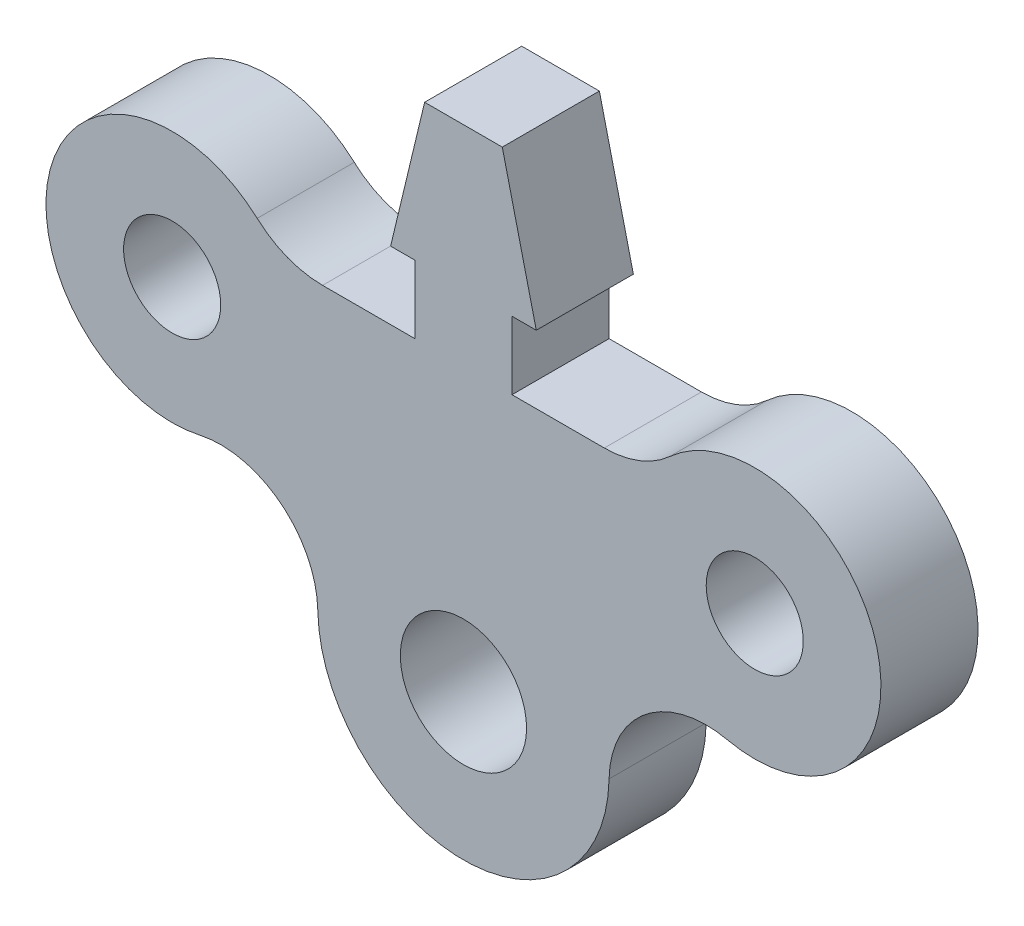
ISO-10303-21;
HEADER;
FILE_DESCRIPTION(('STEP AP214'),'2;1');
FILE_NAME('part.step','',(''),(''),'','','');
FILE_SCHEMA(('AUTOMOTIVE_DESIGN { 1 0 10303 214 1 1 1 1 }'));
ENDSEC;
DATA;
#1=APPLICATION_CONTEXT('core data for automotive mechanical design processes');
#2=APPLICATION_PROTOCOL_DEFINITION('international standard','automotive_design',2000,#1);
#3=PRODUCT_CONTEXT('',#1,'mechanical');
#4=PRODUCT('Part','Part','',(#3));
#5=PRODUCT_RELATED_PRODUCT_CATEGORY('part','',(#4));
#6=PRODUCT_DEFINITION_FORMATION('','',#4);
#7=PRODUCT_DEFINITION_CONTEXT('part definition',#1,'design');
#8=PRODUCT_DEFINITION('design','',#6,#7);
#9=PRODUCT_DEFINITION_SHAPE('','',#8);
#10=(LENGTH_UNIT() NAMED_UNIT(*) SI_UNIT(.MILLI.,.METRE.));
#11=(NAMED_UNIT(*) PLANE_ANGLE_UNIT() SI_UNIT($,.RADIAN.));
#12=(NAMED_UNIT(*) SI_UNIT($,.STERADIAN.) SOLID_ANGLE_UNIT());
#13=UNCERTAINTY_MEASURE_WITH_UNIT(LENGTH_MEASURE(1.E-05),#10,'distance_accuracy_value','');
#14=(GEOMETRIC_REPRESENTATION_CONTEXT(3) GLOBAL_UNCERTAINTY_ASSIGNED_CONTEXT((#13)) GLOBAL_UNIT_ASSIGNED_CONTEXT((#10,
#11,#12)) REPRESENTATION_CONTEXT('',''));
#15=CARTESIAN_POINT('',(0.,0.,0.));
#16=DIRECTION('',(0.,0.,1.));
#17=DIRECTION('',(1.,0.,0.));
#18=AXIS2_PLACEMENT_3D('',#15,#16,#17);
#19=CARTESIAN_POINT('',(33.9601166025852,20.106578028394,10.));
#20=DIRECTION('',(0.,0.,1.));
#21=DIRECTION('',(1.,0.,0.));
#22=AXIS2_PLACEMENT_3D('',#19,#20,#21);
#23=PLANE('',#22);
#24=CARTESIAN_POINT('',(49.4520499874148,3.10657802839401,10.));
#25=DIRECTION('',(0.,0.,1.));
#26=DIRECTION('',(-1.,0.,0.));
#27=AXIS2_PLACEMENT_3D('',#24,#25,#26);
#28=CIRCLE('',#27,4.99999999999998);
#29=CARTESIAN_POINT('',(44.4520499874148,3.10657802839401,10.));
#30=VERTEX_POINT('',#29);
#31=EDGE_CURVE('E394',#30,#30,#28,.T.);
#32=ORIENTED_EDGE('',*,*,#31,.F.);
#33=EDGE_LOOP('',(#32));
#34=FACE_BOUND('',#33,.T.);
#35=DIRECTION('',(0.,-1.,0.));
#36=VECTOR('',#35,1.);
#37=CARTESIAN_POINT('',(14.4520499874148,10.106578028394,10.));
#38=LINE('',#37,#36);
#39=CARTESIAN_POINT('',(14.4520499874148,17.106578028394,10.));
#40=VERTEX_POINT('',#39);
#41=CARTESIAN_POINT('',(14.4520499874148,10.106578028394,10.));
#42=VERTEX_POINT('',#41);
#43=EDGE_CURVE('E238',#40,#42,#38,.T.);
#44=ORIENTED_EDGE('',*,*,#43,.T.);
#45=DIRECTION('',(-1.,0.,0.));
#46=VECTOR('',#45,1.);
#47=CARTESIAN_POINT('',(14.4520499874148,10.106578028394,10.));
#48=LINE('',#47,#46);
#49=CARTESIAN_POINT('',(4.94398337224448,10.106578028394,10.));
#50=VERTEX_POINT('',#49);
#51=EDGE_CURVE('E126',#42,#50,#48,.T.);
#52=ORIENTED_EDGE('',*,*,#51,.T.);
#53=CARTESIAN_POINT('',(4.94398337224448,20.106578028394,10.));
#54=DIRECTION('',(0.,0.,-1.));
#55=DIRECTION('',(-1.,0.,0.));
#56=AXIS2_PLACEMENT_3D('',#53,#54,#55);
#57=CIRCLE('',#56,10.);
#58=CARTESIAN_POINT('',(-1.79163983855102,12.7152736805679,10.));
#59=VERTEX_POINT('',#58);
#60=EDGE_CURVE('E291',#50,#59,#57,.T.);
#61=ORIENTED_EDGE('',*,*,#60,.T.);
#62=CARTESIAN_POINT('',(-10.5479500125852,3.10657802839401,10.));
#63=DIRECTION('',(0.,0.,1.));
#64=DIRECTION('',(1.,0.,0.));
#65=AXIS2_PLACEMENT_3D('',#62,#63,#64);
#66=CIRCLE('',#65,13.);
#67=CARTESIAN_POINT('',(-7.71958344059088,-9.58201300979558,10.));
#68=VERTEX_POINT('',#67);
#69=EDGE_CURVE('E311',#59,#68,#66,.T.);
#70=ORIENTED_EDGE('',*,*,#69,.T.);
#71=CARTESIAN_POINT('',(-5.5439168467491,-19.3424676545568,10.));
#72=DIRECTION('',(0.,0.,-1.));
#73=DIRECTION('',(-1.,0.,0.));
#74=AXIS2_PLACEMENT_3D('',#71,#72,#73);
#75=CIRCLE('',#74,10.);
#76=CARTESIAN_POINT('',(4.45446988691647,-19.1628493813765,10.));
#77=VERTEX_POINT('',#76);
#78=EDGE_CURVE('E307',#68,#77,#75,.T.);
#79=ORIENTED_EDGE('',*,*,#78,.T.);
#80=CARTESIAN_POINT('',(19.4520499874148,-18.893421971606,10.));
#81=DIRECTION('',(0.,0.,1.));
#82=DIRECTION('',(1.,0.,0.));
#83=AXIS2_PLACEMENT_3D('',#80,#81,#82);
#84=CIRCLE('',#83,15.);
#85=CARTESIAN_POINT('',(34.4496300879132,-19.1628493813765,10.));
#86=VERTEX_POINT('',#85);
#87=EDGE_CURVE('E310',#77,#86,#84,.T.);
#88=ORIENTED_EDGE('',*,*,#87,.T.);
#89=CARTESIAN_POINT('',(44.4480168215788,-19.3424676545568,10.));
#90=DIRECTION('',(0.,0.,-1.));
#91=DIRECTION('',(1.,0.,0.));
#92=AXIS2_PLACEMENT_3D('',#89,#90,#91);
#93=CIRCLE('',#92,10.);
#94=CARTESIAN_POINT('',(46.6236834154205,-9.58201300979558,10.));
#95=VERTEX_POINT('',#94);
#96=EDGE_CURVE('E315',#86,#95,#93,.T.);
#97=ORIENTED_EDGE('',*,*,#96,.T.);
#98=CARTESIAN_POINT('',(49.4520499874148,3.10657802839401,10.));
#99=DIRECTION('',(0.,0.,1.));
#100=DIRECTION('',(-1.,0.,0.));
#101=AXIS2_PLACEMENT_3D('',#98,#99,#100);
#102=CIRCLE('',#101,13.);
#103=CARTESIAN_POINT('',(40.6957398133807,12.7152736805679,10.));
#104=VERTEX_POINT('',#103);
#105=EDGE_CURVE('E322',#95,#104,#102,.T.);
#106=ORIENTED_EDGE('',*,*,#105,.T.);
#107=CARTESIAN_POINT('',(33.9601166025852,20.106578028394,10.));
#108=DIRECTION('',(0.,0.,-1.));
#109=DIRECTION('',(1.,0.,0.));
#110=AXIS2_PLACEMENT_3D('',#107,#108,#109);
#111=CIRCLE('',#110,9.99999999999999);
#112=CARTESIAN_POINT('',(33.9601166025852,10.106578028394,10.));
#113=VERTEX_POINT('',#112);
#114=EDGE_CURVE('E325',#104,#113,#111,.T.);
#115=ORIENTED_EDGE('',*,*,#114,.T.);
#116=DIRECTION('',(-1.,0.,0.));
#117=VECTOR('',#116,1.);
#118=CARTESIAN_POINT('',(24.4520499874148,10.106578028394,10.));
#119=LINE('',#118,#117);
#120=CARTESIAN_POINT('',(24.4520499874148,10.106578028394,10.));
#121=VERTEX_POINT('',#120);
#122=EDGE_CURVE('E328',#113,#121,#119,.T.);
#123=ORIENTED_EDGE('',*,*,#122,.T.);
#124=DIRECTION('',(0.,1.,0.));
#125=VECTOR('',#124,1.);
#126=CARTESIAN_POINT('',(24.4520499874148,10.106578028394,10.));
#127=LINE('',#126,#125);
#128=CARTESIAN_POINT('',(24.4520499874148,17.106578028394,10.));
#129=VERTEX_POINT('',#128);
#130=EDGE_CURVE('E331',#121,#129,#127,.T.);
#131=ORIENTED_EDGE('',*,*,#130,.T.);
#132=DIRECTION('',(1.,0.,0.));
#133=VECTOR('',#132,1.);
#134=CARTESIAN_POINT('',(24.4520499874148,17.106578028394,10.));
#135=LINE('',#134,#133);
#136=CARTESIAN_POINT('',(26.9520499874148,17.106578028394,10.));
#137=VERTEX_POINT('',#136);
#138=EDGE_CURVE('E334',#129,#137,#135,.T.);
#139=ORIENTED_EDGE('',*,*,#138,.T.);
#140=DIRECTION('',(-0.233383056617011,0.972384876930992,0.));
#141=VECTOR('',#140,1.);
#142=CARTESIAN_POINT('',(26.9520499874148,17.106578028394,10.));
#143=LINE('',#142,#141);
#144=CARTESIAN_POINT('',(23.4513041381597,31.6923511823589,10.));
#145=VERTEX_POINT('',#144);
#146=EDGE_CURVE('E169',#137,#145,#143,.T.);
#147=ORIENTED_EDGE('',*,*,#146,.T.);
#148=DIRECTION('',(-1.,0.,0.));
#149=VECTOR('',#148,1.);
#150=CARTESIAN_POINT('',(23.4513041381597,31.6923511823589,10.));
#151=LINE('',#150,#149);
#152=CARTESIAN_POINT('',(15.45279583667,31.6923511823589,10.));
#153=VERTEX_POINT('',#152);
#154=EDGE_CURVE('E163',#145,#153,#151,.T.);
#155=ORIENTED_EDGE('',*,*,#154,.T.);
#156=DIRECTION('',(-0.233383056617011,-0.972384876930992,0.));
#157=VECTOR('',#156,1.);
#158=CARTESIAN_POINT('',(11.9520499874148,17.106578028394,10.));
#159=LINE('',#158,#157);
#160=CARTESIAN_POINT('',(11.9520499874148,17.106578028394,10.));
#161=VERTEX_POINT('',#160);
#162=EDGE_CURVE('E167',#153,#161,#159,.T.);
#163=ORIENTED_EDGE('',*,*,#162,.T.);
#164=DIRECTION('',(1.,0.,0.));
#165=VECTOR('',#164,1.);
#166=CARTESIAN_POINT('',(14.4520499874148,17.106578028394,10.));
#167=LINE('',#166,#165);
#168=EDGE_CURVE('E59',#161,#40,#167,.T.);
#169=ORIENTED_EDGE('',*,*,#168,.T.);
#170=EDGE_LOOP('',(#44,#52,#61,#70,#79,#88,#97,#106,#115,#123,#131,#139,#147,#155,#163,#169));
#171=FACE_BOUND('',#170,.T.);
#172=CARTESIAN_POINT('',(-10.5479500125852,3.10657802839401,10.));
#173=DIRECTION('',(0.,0.,1.));
#174=DIRECTION('',(1.,0.,0.));
#175=AXIS2_PLACEMENT_3D('',#172,#173,#174);
#176=CIRCLE('',#175,5.);
#177=CARTESIAN_POINT('',(-5.54795001258518,3.10657802839401,10.));
#178=VERTEX_POINT('',#177);
#179=EDGE_CURVE('E195',#178,#178,#176,.T.);
#180=ORIENTED_EDGE('',*,*,#179,.F.);
#181=EDGE_LOOP('',(#180));
#182=FACE_BOUND('',#181,.T.);
#183=CARTESIAN_POINT('',(19.4520499874148,-18.893421971606,10.));
#184=DIRECTION('',(0.,0.,1.));
#185=DIRECTION('',(1.,0.,0.));
#186=AXIS2_PLACEMENT_3D('',#183,#184,#185);
#187=CIRCLE('',#186,6.5);
#188=CARTESIAN_POINT('',(25.9520499874148,-18.893421971606,10.));
#189=VERTEX_POINT('',#188);
#190=EDGE_CURVE('E383',#189,#189,#187,.T.);
#191=ORIENTED_EDGE('',*,*,#190,.F.);
#192=EDGE_LOOP('',(#191));
#193=FACE_BOUND('',#192,.T.);
#194=ADVANCED_FACE('F41',(#34,#171,#182,#193),#23,.T.);
#195=CARTESIAN_POINT('',(33.9601166025852,20.106578028394,0.));
#196=DIRECTION('',(0.,0.,1.));
#197=DIRECTION('',(1.,0.,0.));
#198=AXIS2_PLACEMENT_3D('',#195,#196,#197);
#199=PLANE('',#198);
#200=DIRECTION('',(0.,-1.,0.));
#201=VECTOR('',#200,1.);
#202=CARTESIAN_POINT('',(14.4520499874148,10.106578028394,0.));
#203=LINE('',#202,#201);
#204=CARTESIAN_POINT('',(14.4520499874148,17.106578028394,0.));
#205=VERTEX_POINT('',#204);
#206=CARTESIAN_POINT('',(14.4520499874148,10.106578028394,0.));
#207=VERTEX_POINT('',#206);
#208=EDGE_CURVE('E190',#205,#207,#203,.T.);
#209=ORIENTED_EDGE('',*,*,#208,.F.);
#210=DIRECTION('',(1.,0.,0.));
#211=VECTOR('',#210,1.);
#212=CARTESIAN_POINT('',(14.4520499874148,17.106578028394,0.));
#213=LINE('',#212,#211);
#214=CARTESIAN_POINT('',(11.9520499874148,17.106578028394,0.));
#215=VERTEX_POINT('',#214);
#216=EDGE_CURVE('E118',#215,#205,#213,.T.);
#217=ORIENTED_EDGE('',*,*,#216,.F.);
#218=DIRECTION('',(-0.233383056617011,-0.972384876930992,0.));
#219=VECTOR('',#218,1.);
#220=CARTESIAN_POINT('',(11.9520499874148,17.106578028394,0.));
#221=LINE('',#220,#219);
#222=CARTESIAN_POINT('',(15.45279583667,31.6923511823589,0.));
#223=VERTEX_POINT('',#222);
#224=EDGE_CURVE('E112',#223,#215,#221,.T.);
#225=ORIENTED_EDGE('',*,*,#224,.F.);
#226=DIRECTION('',(-1.,0.,0.));
#227=VECTOR('',#226,1.);
#228=CARTESIAN_POINT('',(15.45279583667,31.6923511823589,0.));
#229=LINE('',#228,#227);
#230=CARTESIAN_POINT('',(23.4513041381597,31.6923511823589,0.));
#231=VERTEX_POINT('',#230);
#232=EDGE_CURVE('E177',#231,#223,#229,.T.);
#233=ORIENTED_EDGE('',*,*,#232,.F.);
#234=DIRECTION('',(-0.233383056617011,0.972384876930992,0.));
#235=VECTOR('',#234,1.);
#236=CARTESIAN_POINT('',(26.9520499874148,17.106578028394,0.));
#237=LINE('',#236,#235);
#238=CARTESIAN_POINT('',(26.9520499874148,17.106578028394,0.));
#239=VERTEX_POINT('',#238);
#240=EDGE_CURVE('E228',#239,#231,#237,.T.);
#241=ORIENTED_EDGE('',*,*,#240,.F.);
#242=DIRECTION('',(1.,0.,0.));
#243=VECTOR('',#242,1.);
#244=CARTESIAN_POINT('',(24.4520499874148,17.106578028394,0.));
#245=LINE('',#244,#243);
#246=CARTESIAN_POINT('',(24.4520499874148,17.106578028394,0.));
#247=VERTEX_POINT('',#246);
#248=EDGE_CURVE('E225',#247,#239,#245,.T.);
#249=ORIENTED_EDGE('',*,*,#248,.F.);
#250=DIRECTION('',(0.,1.,0.));
#251=VECTOR('',#250,1.);
#252=CARTESIAN_POINT('',(24.4520499874148,10.106578028394,0.));
#253=LINE('',#252,#251);
#254=CARTESIAN_POINT('',(24.4520499874148,10.106578028394,0.));
#255=VERTEX_POINT('',#254);
#256=EDGE_CURVE('E222',#255,#247,#253,.T.);
#257=ORIENTED_EDGE('',*,*,#256,.F.);
#258=DIRECTION('',(-1.,0.,0.));
#259=VECTOR('',#258,1.);
#260=CARTESIAN_POINT('',(24.4520499874148,10.106578028394,0.));
#261=LINE('',#260,#259);
#262=CARTESIAN_POINT('',(33.9601166025852,10.106578028394,0.));
#263=VERTEX_POINT('',#262);
#264=EDGE_CURVE('E219',#263,#255,#261,.T.);
#265=ORIENTED_EDGE('',*,*,#264,.F.);
#266=CARTESIAN_POINT('',(33.9601166025852,20.106578028394,0.));
#267=DIRECTION('',(0.,0.,-1.));
#268=DIRECTION('',(1.,0.,0.));
#269=AXIS2_PLACEMENT_3D('',#266,#267,#268);
#270=CIRCLE('',#269,9.99999999999999);
#271=CARTESIAN_POINT('',(40.6957398133807,12.7152736805679,0.));
#272=VERTEX_POINT('',#271);
#273=EDGE_CURVE('E216',#272,#263,#270,.T.);
#274=ORIENTED_EDGE('',*,*,#273,.F.);
#275=CARTESIAN_POINT('',(49.4520499874148,3.10657802839401,0.));
#276=DIRECTION('',(0.,0.,1.));
#277=DIRECTION('',(-1.,0.,0.));
#278=AXIS2_PLACEMENT_3D('',#275,#276,#277);
#279=CIRCLE('',#278,13.);
#280=CARTESIAN_POINT('',(46.6236834154205,-9.58201300979558,0.));
#281=VERTEX_POINT('',#280);
#282=EDGE_CURVE('E213',#281,#272,#279,.T.);
#283=ORIENTED_EDGE('',*,*,#282,.F.);
#284=CARTESIAN_POINT('',(44.4480168215788,-19.3424676545568,0.));
#285=DIRECTION('',(0.,0.,-1.));
#286=DIRECTION('',(1.,0.,0.));
#287=AXIS2_PLACEMENT_3D('',#284,#285,#286);
#288=CIRCLE('',#287,10.);
#289=CARTESIAN_POINT('',(34.4496300879132,-19.1628493813765,0.));
#290=VERTEX_POINT('',#289);
#291=EDGE_CURVE('E210',#290,#281,#288,.T.);
#292=ORIENTED_EDGE('',*,*,#291,.F.);
#293=CARTESIAN_POINT('',(19.4520499874148,-18.893421971606,0.));
#294=DIRECTION('',(0.,0.,1.));
#295=DIRECTION('',(1.,0.,0.));
#296=AXIS2_PLACEMENT_3D('',#293,#294,#295);
#297=CIRCLE('',#296,15.);
#298=CARTESIAN_POINT('',(4.45446988691647,-19.1628493813765,0.));
#299=VERTEX_POINT('',#298);
#300=EDGE_CURVE('E207',#299,#290,#297,.T.);
#301=ORIENTED_EDGE('',*,*,#300,.F.);
#302=CARTESIAN_POINT('',(-5.5439168467491,-19.3424676545568,0.));
#303=DIRECTION('',(0.,0.,-1.));
#304=DIRECTION('',(-1.,0.,0.));
#305=AXIS2_PLACEMENT_3D('',#302,#303,#304);
#306=CIRCLE('',#305,10.);
#307=CARTESIAN_POINT('',(-7.71958344059088,-9.58201300979558,0.));
#308=VERTEX_POINT('',#307);
#309=EDGE_CURVE('E204',#308,#299,#306,.T.);
#310=ORIENTED_EDGE('',*,*,#309,.F.);
#311=CARTESIAN_POINT('',(-10.5479500125852,3.10657802839401,0.));
#312=DIRECTION('',(0.,0.,1.));
#313=DIRECTION('',(1.,0.,0.));
#314=AXIS2_PLACEMENT_3D('',#311,#312,#313);
#315=CIRCLE('',#314,13.);
#316=CARTESIAN_POINT('',(-1.79163983855102,12.7152736805679,0.));
#317=VERTEX_POINT('',#316);
#318=EDGE_CURVE('E201',#317,#308,#315,.T.);
#319=ORIENTED_EDGE('',*,*,#318,.F.);
#320=CARTESIAN_POINT('',(4.94398337224448,20.106578028394,0.));
#321=DIRECTION('',(0.,0.,-1.));
#322=DIRECTION('',(-1.,0.,0.));
#323=AXIS2_PLACEMENT_3D('',#320,#321,#322);
#324=CIRCLE('',#323,10.);
#325=CARTESIAN_POINT('',(4.94398337224448,10.106578028394,0.));
#326=VERTEX_POINT('',#325);
#327=EDGE_CURVE('E198',#326,#317,#324,.T.);
#328=ORIENTED_EDGE('',*,*,#327,.F.);
#329=DIRECTION('',(-1.,0.,0.));
#330=VECTOR('',#329,1.);
#331=CARTESIAN_POINT('',(14.4520499874148,10.106578028394,0.));
#332=LINE('',#331,#330);
#333=EDGE_CURVE('E194',#207,#326,#332,.T.);
#334=ORIENTED_EDGE('',*,*,#333,.F.);
#335=EDGE_LOOP('',(#209,#217,#225,#233,#241,#249,#257,#265,#274,#283,#292,#301,#310,#319,#328,#334));
#336=FACE_BOUND('',#335,.T.);
#337=CARTESIAN_POINT('',(-10.5479500125852,3.10657802839401,0.));
#338=DIRECTION('',(0.,0.,1.));
#339=DIRECTION('',(1.,0.,0.));
#340=AXIS2_PLACEMENT_3D('',#337,#338,#339);
#341=CIRCLE('',#340,5.);
#342=CARTESIAN_POINT('',(-5.54795001258518,3.10657802839401,0.));
#343=VERTEX_POINT('',#342);
#344=EDGE_CURVE('E398',#343,#343,#341,.T.);
#345=ORIENTED_EDGE('',*,*,#344,.T.);
#346=EDGE_LOOP('',(#345));
#347=FACE_BOUND('',#346,.T.);
#348=CARTESIAN_POINT('',(49.4520499874148,3.10657802839401,0.));
#349=DIRECTION('',(0.,0.,1.));
#350=DIRECTION('',(-1.,0.,0.));
#351=AXIS2_PLACEMENT_3D('',#348,#349,#350);
#352=CIRCLE('',#351,4.99999999999998);
#353=CARTESIAN_POINT('',(44.4520499874148,3.10657802839401,0.));
#354=VERTEX_POINT('',#353);
#355=EDGE_CURVE('E391',#354,#354,#352,.T.);
#356=ORIENTED_EDGE('',*,*,#355,.T.);
#357=EDGE_LOOP('',(#356));
#358=FACE_BOUND('',#357,.T.);
#359=CARTESIAN_POINT('',(19.4520499874148,-18.893421971606,0.));
#360=DIRECTION('',(0.,0.,1.));
#361=DIRECTION('',(1.,0.,0.));
#362=AXIS2_PLACEMENT_3D('',#359,#360,#361);
#363=CIRCLE('',#362,6.5);
#364=CARTESIAN_POINT('',(25.9520499874148,-18.893421971606,0.));
#365=VERTEX_POINT('',#364);
#366=EDGE_CURVE('E386',#365,#365,#363,.T.);
#367=ORIENTED_EDGE('',*,*,#366,.T.);
#368=EDGE_LOOP('',(#367));
#369=FACE_BOUND('',#368,.T.);
#370=ADVANCED_FACE('F295',(#336,#347,#358,#369),#199,.F.);
#371=CARTESIAN_POINT('',(14.4520499874148,10.106578028394,10.));
#372=DIRECTION('',(1.,0.,0.));
#373=DIRECTION('',(0.,1.,0.));
#374=AXIS2_PLACEMENT_3D('',#371,#372,#373);
#375=PLANE('',#374);
#376=ORIENTED_EDGE('',*,*,#208,.T.);
#377=DIRECTION('',(0.,0.,-1.));
#378=VECTOR('',#377,1.);
#379=CARTESIAN_POINT('',(14.4520499874148,10.106578028394,10.));
#380=LINE('',#379,#378);
#381=EDGE_CURVE('E11',#42,#207,#380,.T.);
#382=ORIENTED_EDGE('',*,*,#381,.F.);
#383=ORIENTED_EDGE('',*,*,#43,.F.);
#384=DIRECTION('',(0.,0.,-1.));
#385=VECTOR('',#384,1.);
#386=CARTESIAN_POINT('',(14.4520499874148,17.106578028394,10.));
#387=LINE('',#386,#385);
#388=EDGE_CURVE('E186',#40,#205,#387,.T.);
#389=ORIENTED_EDGE('',*,*,#388,.T.);
#390=EDGE_LOOP('',(#376,#382,#383,#389));
#391=FACE_BOUND('',#390,.T.);
#392=ADVANCED_FACE('F43',(#391),#375,.F.);
#393=CARTESIAN_POINT('',(14.4520499874148,10.106578028394,10.));
#394=DIRECTION('',(0.,-1.,0.));
#395=DIRECTION('',(0.,0.,-1.));
#396=AXIS2_PLACEMENT_3D('',#393,#394,#395);
#397=PLANE('',#396);
#398=ORIENTED_EDGE('',*,*,#333,.T.);
#399=DIRECTION('',(0.,0.,-1.));
#400=VECTOR('',#399,1.);
#401=CARTESIAN_POINT('',(4.94398337224448,10.106578028394,10.));
#402=LINE('',#401,#400);
#403=EDGE_CURVE('E51',#50,#326,#402,.T.);
#404=ORIENTED_EDGE('',*,*,#403,.F.);
#405=ORIENTED_EDGE('',*,*,#51,.F.);
#406=ORIENTED_EDGE('',*,*,#381,.T.);
#407=EDGE_LOOP('',(#398,#404,#405,#406));
#408=FACE_BOUND('',#407,.T.);
#409=ADVANCED_FACE('F547',(#408),#397,.F.);
#410=CARTESIAN_POINT('',(4.94398337224448,20.106578028394,10.));
#411=DIRECTION('',(0.,0.,-1.));
#412=DIRECTION('',(-1.,0.,0.));
#413=AXIS2_PLACEMENT_3D('',#410,#411,#412);
#414=CYLINDRICAL_SURFACE('',#413,10.);
#415=ORIENTED_EDGE('',*,*,#327,.T.);
#416=DIRECTION('',(0.,0.,-1.));
#417=VECTOR('',#416,1.);
#418=CARTESIAN_POINT('',(-1.79163983855102,12.7152736805679,10.));
#419=LINE('',#418,#417);
#420=EDGE_CURVE('E281',#59,#317,#419,.T.);
#421=ORIENTED_EDGE('',*,*,#420,.F.);
#422=ORIENTED_EDGE('',*,*,#60,.F.);
#423=ORIENTED_EDGE('',*,*,#403,.T.);
#424=EDGE_LOOP('',(#415,#421,#422,#423));
#425=FACE_BOUND('',#424,.T.);
#426=ADVANCED_FACE('F289',(#425),#414,.F.);
#427=CARTESIAN_POINT('',(-10.5479500125852,3.10657802839401,10.));
#428=DIRECTION('',(0.,0.,-1.));
#429=DIRECTION('',(-1.,0.,0.));
#430=AXIS2_PLACEMENT_3D('',#427,#428,#429);
#431=CYLINDRICAL_SURFACE('',#430,13.);
#432=ORIENTED_EDGE('',*,*,#318,.T.);
#433=DIRECTION('',(0.,0.,-1.));
#434=VECTOR('',#433,1.);
#435=CARTESIAN_POINT('',(-7.71958344059088,-9.58201300979558,10.));
#436=LINE('',#435,#434);
#437=EDGE_CURVE('E277',#68,#308,#436,.T.);
#438=ORIENTED_EDGE('',*,*,#437,.F.);
#439=ORIENTED_EDGE('',*,*,#69,.F.);
#440=ORIENTED_EDGE('',*,*,#420,.T.);
#441=EDGE_LOOP('',(#432,#438,#439,#440));
#442=FACE_BOUND('',#441,.T.);
#443=ADVANCED_FACE('F301',(#442),#431,.T.);
#444=CARTESIAN_POINT('',(-5.5439168467491,-19.3424676545568,10.));
#445=DIRECTION('',(0.,0.,-1.));
#446=DIRECTION('',(-1.,0.,0.));
#447=AXIS2_PLACEMENT_3D('',#444,#445,#446);
#448=CYLINDRICAL_SURFACE('',#447,10.);
#449=ORIENTED_EDGE('',*,*,#309,.T.);
#450=DIRECTION('',(0.,0.,-1.));
#451=VECTOR('',#450,1.);
#452=CARTESIAN_POINT('',(4.45446988691647,-19.1628493813765,10.));
#453=LINE('',#452,#451);
#454=EDGE_CURVE('E273',#77,#299,#453,.T.);
#455=ORIENTED_EDGE('',*,*,#454,.F.);
#456=ORIENTED_EDGE('',*,*,#78,.F.);
#457=ORIENTED_EDGE('',*,*,#437,.T.);
#458=EDGE_LOOP('',(#449,#455,#456,#457));
#459=FACE_BOUND('',#458,.T.);
#460=ADVANCED_FACE('F305',(#459),#448,.F.);
#461=CARTESIAN_POINT('',(19.4520499874148,-18.893421971606,10.));
#462=DIRECTION('',(0.,0.,-1.));
#463=DIRECTION('',(-1.,0.,0.));
#464=AXIS2_PLACEMENT_3D('',#461,#462,#463);
#465=CYLINDRICAL_SURFACE('',#464,15.);
#466=ORIENTED_EDGE('',*,*,#300,.T.);
#467=DIRECTION('',(0.,0.,-1.));
#468=VECTOR('',#467,1.);
#469=CARTESIAN_POINT('',(34.4496300879132,-19.1628493813765,10.));
#470=LINE('',#469,#468);
#471=EDGE_CURVE('E269',#86,#290,#470,.T.);
#472=ORIENTED_EDGE('',*,*,#471,.F.);
#473=ORIENTED_EDGE('',*,*,#87,.F.);
#474=ORIENTED_EDGE('',*,*,#454,.T.);
#475=EDGE_LOOP('',(#466,#472,#473,#474));
#476=FACE_BOUND('',#475,.T.);
#477=ADVANCED_FACE('F512',(#476),#465,.T.);
#478=CARTESIAN_POINT('',(44.4480168215788,-19.3424676545568,10.));
#479=DIRECTION('',(0.,0.,-1.));
#480=DIRECTION('',(-1.,0.,0.));
#481=AXIS2_PLACEMENT_3D('',#478,#479,#480);
#482=CYLINDRICAL_SURFACE('',#481,10.);
#483=ORIENTED_EDGE('',*,*,#291,.T.);
#484=DIRECTION('',(0.,0.,-1.));
#485=VECTOR('',#484,1.);
#486=CARTESIAN_POINT('',(46.6236834154205,-9.58201300979558,10.));
#487=LINE('',#486,#485);
#488=EDGE_CURVE('E265',#95,#281,#487,.T.);
#489=ORIENTED_EDGE('',*,*,#488,.F.);
#490=ORIENTED_EDGE('',*,*,#96,.F.);
#491=ORIENTED_EDGE('',*,*,#471,.T.);
#492=EDGE_LOOP('',(#483,#489,#490,#491));
#493=FACE_BOUND('',#492,.T.);
#494=ADVANCED_FACE('F502',(#493),#482,.F.);
#495=CARTESIAN_POINT('',(49.4520499874148,3.10657802839401,10.));
#496=DIRECTION('',(0.,0.,-1.));
#497=DIRECTION('',(-1.,0.,0.));
#498=AXIS2_PLACEMENT_3D('',#495,#496,#497);
#499=CYLINDRICAL_SURFACE('',#498,13.);
#500=ORIENTED_EDGE('',*,*,#282,.T.);
#501=DIRECTION('',(0.,0.,-1.));
#502=VECTOR('',#501,1.);
#503=CARTESIAN_POINT('',(40.6957398133807,12.7152736805679,10.));
#504=LINE('',#503,#502);
#505=EDGE_CURVE('E261',#104,#272,#504,.T.);
#506=ORIENTED_EDGE('',*,*,#505,.F.);
#507=ORIENTED_EDGE('',*,*,#105,.F.);
#508=ORIENTED_EDGE('',*,*,#488,.T.);
#509=EDGE_LOOP('',(#500,#506,#507,#508));
#510=FACE_BOUND('',#509,.T.);
#511=ADVANCED_FACE('F492',(#510),#499,.T.);
#512=CARTESIAN_POINT('',(33.9601166025852,20.106578028394,10.));
#513=DIRECTION('',(0.,0.,-1.));
#514=DIRECTION('',(-1.,0.,0.));
#515=AXIS2_PLACEMENT_3D('',#512,#513,#514);
#516=CYLINDRICAL_SURFACE('',#515,9.99999999999999);
#517=ORIENTED_EDGE('',*,*,#273,.T.);
#518=DIRECTION('',(0.,0.,-1.));
#519=VECTOR('',#518,1.);
#520=CARTESIAN_POINT('',(33.9601166025852,10.106578028394,10.));
#521=LINE('',#520,#519);
#522=EDGE_CURVE('E257',#113,#263,#521,.T.);
#523=ORIENTED_EDGE('',*,*,#522,.F.);
#524=ORIENTED_EDGE('',*,*,#114,.F.);
#525=ORIENTED_EDGE('',*,*,#505,.T.);
#526=EDGE_LOOP('',(#517,#523,#524,#525));
#527=FACE_BOUND('',#526,.T.);
#528=ADVANCED_FACE('F482',(#527),#516,.F.);
#529=CARTESIAN_POINT('',(24.4520499874148,10.106578028394,10.));
#530=DIRECTION('',(0.,-1.,0.));
#531=DIRECTION('',(0.,0.,-1.));
#532=AXIS2_PLACEMENT_3D('',#529,#530,#531);
#533=PLANE('',#532);
#534=ORIENTED_EDGE('',*,*,#264,.T.);
#535=DIRECTION('',(0.,0.,-1.));
#536=VECTOR('',#535,1.);
#537=CARTESIAN_POINT('',(24.4520499874148,10.106578028394,10.));
#538=LINE('',#537,#536);
#539=EDGE_CURVE('E253',#121,#255,#538,.T.);
#540=ORIENTED_EDGE('',*,*,#539,.F.);
#541=ORIENTED_EDGE('',*,*,#122,.F.);
#542=ORIENTED_EDGE('',*,*,#522,.T.);
#543=EDGE_LOOP('',(#534,#540,#541,#542));
#544=FACE_BOUND('',#543,.T.);
#545=ADVANCED_FACE('F472',(#544),#533,.F.);
#546=CARTESIAN_POINT('',(24.4520499874148,10.106578028394,10.));
#547=DIRECTION('',(-1.,0.,0.));
#548=DIRECTION('',(0.,0.,1.));
#549=AXIS2_PLACEMENT_3D('',#546,#547,#548);
#550=PLANE('',#549);
#551=ORIENTED_EDGE('',*,*,#256,.T.);
#552=DIRECTION('',(0.,0.,-1.));
#553=VECTOR('',#552,1.);
#554=CARTESIAN_POINT('',(24.4520499874148,17.106578028394,10.));
#555=LINE('',#554,#553);
#556=EDGE_CURVE('E249',#129,#247,#555,.T.);
#557=ORIENTED_EDGE('',*,*,#556,.F.);
#558=ORIENTED_EDGE('',*,*,#130,.F.);
#559=ORIENTED_EDGE('',*,*,#539,.T.);
#560=EDGE_LOOP('',(#551,#557,#558,#559));
#561=FACE_BOUND('',#560,.T.);
#562=ADVANCED_FACE('F463',(#561),#550,.F.);
#563=CARTESIAN_POINT('',(24.4520499874148,17.106578028394,10.));
#564=DIRECTION('',(0.,1.,0.));
#565=DIRECTION('',(0.,0.,1.));
#566=AXIS2_PLACEMENT_3D('',#563,#564,#565);
#567=PLANE('',#566);
#568=ORIENTED_EDGE('',*,*,#248,.T.);
#569=DIRECTION('',(0.,0.,-1.));
#570=VECTOR('',#569,1.);
#571=CARTESIAN_POINT('',(26.9520499874148,17.106578028394,10.));
#572=LINE('',#571,#570);
#573=EDGE_CURVE('E245',#137,#239,#572,.T.);
#574=ORIENTED_EDGE('',*,*,#573,.F.);
#575=ORIENTED_EDGE('',*,*,#138,.F.);
#576=ORIENTED_EDGE('',*,*,#556,.T.);
#577=EDGE_LOOP('',(#568,#574,#575,#576));
#578=FACE_BOUND('',#577,.T.);
#579=ADVANCED_FACE('F342',(#578),#567,.F.);
#580=CARTESIAN_POINT('',(26.9520499874148,17.106578028394,10.));
#581=DIRECTION('',(-0.972384876930993,-0.233383056617011,0.));
#582=DIRECTION('',(0.233383056617011,-0.972384876930993,0.));
#583=AXIS2_PLACEMENT_3D('',#580,#581,#582);
#584=PLANE('',#583);
#585=ORIENTED_EDGE('',*,*,#240,.T.);
#586=DIRECTION('',(0.,0.,-1.));
#587=VECTOR('',#586,1.);
#588=CARTESIAN_POINT('',(23.4513041381597,31.6923511823589,10.));
#589=LINE('',#588,#587);
#590=EDGE_CURVE('E179',#145,#231,#589,.T.);
#591=ORIENTED_EDGE('',*,*,#590,.F.);
#592=ORIENTED_EDGE('',*,*,#146,.F.);
#593=ORIENTED_EDGE('',*,*,#573,.T.);
#594=EDGE_LOOP('',(#585,#591,#592,#593));
#595=FACE_BOUND('',#594,.T.);
#596=ADVANCED_FACE('F346',(#595),#584,.F.);
#597=CARTESIAN_POINT('',(15.45279583667,31.6923511823589,10.));
#598=DIRECTION('',(0.,-1.,0.));
#599=DIRECTION('',(0.,0.,-1.));
#600=AXIS2_PLACEMENT_3D('',#597,#598,#599);
#601=PLANE('',#600);
#602=ORIENTED_EDGE('',*,*,#232,.T.);
#603=DIRECTION('',(0.,0.,-1.));
#604=VECTOR('',#603,1.);
#605=CARTESIAN_POINT('',(15.45279583667,31.6923511823589,10.));
#606=LINE('',#605,#604);
#607=EDGE_CURVE('E175',#153,#223,#606,.T.);
#608=ORIENTED_EDGE('',*,*,#607,.F.);
#609=ORIENTED_EDGE('',*,*,#154,.F.);
#610=ORIENTED_EDGE('',*,*,#590,.T.);
#611=EDGE_LOOP('',(#602,#608,#609,#610));
#612=FACE_BOUND('',#611,.T.);
#613=ADVANCED_FACE('F176',(#612),#601,.F.);
#614=CARTESIAN_POINT('',(11.9520499874148,17.106578028394,10.));
#615=DIRECTION('',(0.972384876930992,-0.233383056617011,0.));
#616=DIRECTION('',(0.233383056617011,0.972384876930992,0.));
#617=AXIS2_PLACEMENT_3D('',#614,#615,#616);
#618=PLANE('',#617);
#619=ORIENTED_EDGE('',*,*,#224,.T.);
#620=DIRECTION('',(0.,0.,-1.));
#621=VECTOR('',#620,1.);
#622=CARTESIAN_POINT('',(11.9520499874148,17.106578028394,10.));
#623=LINE('',#622,#621);
#624=EDGE_CURVE('E180',#161,#215,#623,.T.);
#625=ORIENTED_EDGE('',*,*,#624,.F.);
#626=ORIENTED_EDGE('',*,*,#162,.F.);
#627=ORIENTED_EDGE('',*,*,#607,.T.);
#628=EDGE_LOOP('',(#619,#625,#626,#627));
#629=FACE_BOUND('',#628,.T.);
#630=ADVANCED_FACE('F182',(#629),#618,.F.);
#631=CARTESIAN_POINT('',(14.4520499874148,17.106578028394,10.));
#632=DIRECTION('',(0.,1.,0.));
#633=DIRECTION('',(0.,0.,1.));
#634=AXIS2_PLACEMENT_3D('',#631,#632,#633);
#635=PLANE('',#634);
#636=ORIENTED_EDGE('',*,*,#216,.T.);
#637=ORIENTED_EDGE('',*,*,#388,.F.);
#638=ORIENTED_EDGE('',*,*,#168,.F.);
#639=ORIENTED_EDGE('',*,*,#624,.T.);
#640=EDGE_LOOP('',(#636,#637,#638,#639));
#641=FACE_BOUND('',#640,.T.);
#642=ADVANCED_FACE('F351',(#641),#635,.F.);
#643=CARTESIAN_POINT('',(-10.5479500125852,3.10657802839401,10.));
#644=DIRECTION('',(0.,0.,-1.));
#645=DIRECTION('',(-1.,0.,0.));
#646=AXIS2_PLACEMENT_3D('',#643,#644,#645);
#647=CYLINDRICAL_SURFACE('',#646,5.);
#648=ORIENTED_EDGE('',*,*,#179,.T.);
#649=EDGE_LOOP('',(#648));
#650=FACE_BOUND('',#649,.T.);
#651=ORIENTED_EDGE('',*,*,#344,.F.);
#652=EDGE_LOOP('',(#651));
#653=FACE_BOUND('',#652,.T.);
#654=ADVANCED_FACE('F353',(#650,#653),#647,.F.);
#655=CARTESIAN_POINT('',(49.4520499874148,3.10657802839401,10.));
#656=DIRECTION('',(0.,0.,-1.));
#657=DIRECTION('',(-1.,0.,0.));
#658=AXIS2_PLACEMENT_3D('',#655,#656,#657);
#659=CYLINDRICAL_SURFACE('',#658,4.99999999999998);
#660=ORIENTED_EDGE('',*,*,#31,.T.);
#661=EDGE_LOOP('',(#660));
#662=FACE_BOUND('',#661,.T.);
#663=ORIENTED_EDGE('',*,*,#355,.F.);
#664=EDGE_LOOP('',(#663));
#665=FACE_BOUND('',#664,.T.);
#666=ADVANCED_FACE('F359',(#662,#665),#659,.F.);
#667=CARTESIAN_POINT('',(19.4520499874148,-18.893421971606,10.));
#668=DIRECTION('',(0.,0.,-1.));
#669=DIRECTION('',(-1.,0.,0.));
#670=AXIS2_PLACEMENT_3D('',#667,#668,#669);
#671=CYLINDRICAL_SURFACE('',#670,6.5);
#672=ORIENTED_EDGE('',*,*,#190,.T.);
#673=EDGE_LOOP('',(#672));
#674=FACE_BOUND('',#673,.T.);
#675=ORIENTED_EDGE('',*,*,#366,.F.);
#676=EDGE_LOOP('',(#675));
#677=FACE_BOUND('',#676,.T.);
#678=ADVANCED_FACE('F374',(#674,#677),#671,.F.);
#679=CLOSED_SHELL('',(#194,#370,#392,#409,#426,#443,#460,#477,#494,#511,#528,#545,#562,#579,
#596,#613,#630,#642,#654,#666,#678));
#680=MANIFOLD_SOLID_BREP('B2',#679);
#681=ADVANCED_BREP_SHAPE_REPRESENTATION('',(#18,#680),#14);
#682=SHAPE_DEFINITION_REPRESENTATION(#9,#681);
ENDSEC;
END-ISO-10303-21;
